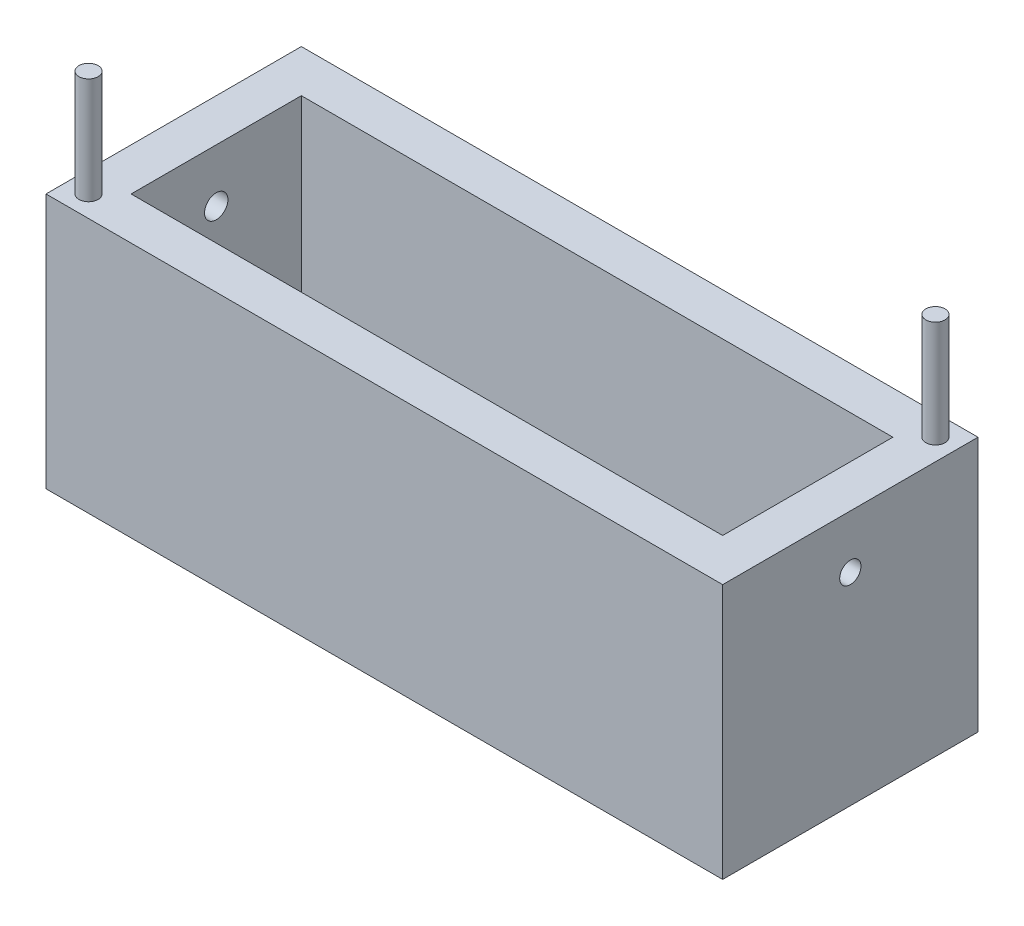
ISO-10303-21;
HEADER;
FILE_DESCRIPTION(('STEP AP214'),'2;1');
FILE_NAME('part.step','',(''),(''),'','','');
FILE_SCHEMA(('AUTOMOTIVE_DESIGN { 1 0 10303 214 1 1 1 1 }'));
ENDSEC;
DATA;
#1=APPLICATION_CONTEXT('core data for automotive mechanical design processes');
#2=APPLICATION_PROTOCOL_DEFINITION('international standard','automotive_design',2000,#1);
#3=PRODUCT_CONTEXT('',#1,'mechanical');
#4=PRODUCT('Part','Part','',(#3));
#5=PRODUCT_RELATED_PRODUCT_CATEGORY('part','',(#4));
#6=PRODUCT_DEFINITION_FORMATION('','',#4);
#7=PRODUCT_DEFINITION_CONTEXT('part definition',#1,'design');
#8=PRODUCT_DEFINITION('design','',#6,#7);
#9=PRODUCT_DEFINITION_SHAPE('','',#8);
#10=(LENGTH_UNIT() NAMED_UNIT(*) SI_UNIT(.MILLI.,.METRE.));
#11=(NAMED_UNIT(*) PLANE_ANGLE_UNIT() SI_UNIT($,.RADIAN.));
#12=(NAMED_UNIT(*) SI_UNIT($,.STERADIAN.) SOLID_ANGLE_UNIT());
#13=UNCERTAINTY_MEASURE_WITH_UNIT(LENGTH_MEASURE(1.E-05),#10,'distance_accuracy_value','');
#14=(GEOMETRIC_REPRESENTATION_CONTEXT(3) GLOBAL_UNCERTAINTY_ASSIGNED_CONTEXT((#13)) GLOBAL_UNIT_ASSIGNED_CONTEXT((#10,
#11,#12)) REPRESENTATION_CONTEXT('',''));
#15=CARTESIAN_POINT('',(0.,0.,0.));
#16=DIRECTION('',(0.,0.,1.));
#17=DIRECTION('',(1.,0.,0.));
#18=AXIS2_PLACEMENT_3D('',#15,#16,#17);
#19=CARTESIAN_POINT('',(0.,0.,152.4));
#20=DIRECTION('',(-1.,0.,0.));
#21=DIRECTION('',(0.,0.,1.));
#22=AXIS2_PLACEMENT_3D('',#19,#20,#21);
#23=PLANE('',#22);
#24=CARTESIAN_POINT('',(0.,120.65,76.2));
#25=DIRECTION('',(1.,0.,0.));
#26=DIRECTION('',(0.,0.,-1.));
#27=AXIS2_PLACEMENT_3D('',#24,#25,#26);
#28=CIRCLE('',#27,6.34999999999999);
#29=CARTESIAN_POINT('',(0.,120.65,69.85));
#30=VERTEX_POINT('',#29);
#31=EDGE_CURVE('E174',#30,#30,#28,.T.);
#32=ORIENTED_EDGE('',*,*,#31,.F.);
#33=EDGE_LOOP('',(#32));
#34=FACE_BOUND('',#33,.T.);
#35=DIRECTION('',(0.,1.,0.));
#36=VECTOR('',#35,1.);
#37=CARTESIAN_POINT('',(0.,0.,0.));
#38=LINE('',#37,#36);
#39=CARTESIAN_POINT('',(0.,0.,0.));
#40=VERTEX_POINT('',#39);
#41=CARTESIAN_POINT('',(0.,152.4,0.));
#42=VERTEX_POINT('',#41);
#43=EDGE_CURVE('E145',#40,#42,#38,.T.);
#44=ORIENTED_EDGE('',*,*,#43,.T.);
#45=DIRECTION('',(0.,0.,-1.));
#46=VECTOR('',#45,1.);
#47=CARTESIAN_POINT('',(0.,152.4,152.4));
#48=LINE('',#47,#46);
#49=CARTESIAN_POINT('',(0.,152.4,152.4));
#50=VERTEX_POINT('',#49);
#51=EDGE_CURVE('E169',#50,#42,#48,.T.);
#52=ORIENTED_EDGE('',*,*,#51,.F.);
#53=DIRECTION('',(0.,1.,0.));
#54=VECTOR('',#53,1.);
#55=CARTESIAN_POINT('',(0.,0.,152.4));
#56=LINE('',#55,#54);
#57=CARTESIAN_POINT('',(0.,0.,152.4));
#58=VERTEX_POINT('',#57);
#59=EDGE_CURVE('E149',#58,#50,#56,.T.);
#60=ORIENTED_EDGE('',*,*,#59,.F.);
#61=DIRECTION('',(0.,0.,-1.));
#62=VECTOR('',#61,1.);
#63=CARTESIAN_POINT('',(0.,0.,152.4));
#64=LINE('',#63,#62);
#65=EDGE_CURVE('E155',#58,#40,#64,.T.);
#66=ORIENTED_EDGE('',*,*,#65,.T.);
#67=EDGE_LOOP('',(#44,#52,#60,#66));
#68=FACE_BOUND('',#67,.T.);
#69=ADVANCED_FACE('F33',(#34,#68),#23,.F.);
#70=CARTESIAN_POINT('',(0.,152.4,152.4));
#71=DIRECTION('',(0.,-1.,0.));
#72=DIRECTION('',(1.,0.,0.));
#73=AXIS2_PLACEMENT_3D('',#70,#71,#72);
#74=PLANE('',#73);
#75=CARTESIAN_POINT('',(-12.7,152.4,12.7));
#76=DIRECTION('',(0.,-1.,0.));
#77=DIRECTION('',(1.,0.,0.));
#78=AXIS2_PLACEMENT_3D('',#75,#76,#77);
#79=CIRCLE('',#78,5.715);
#80=CARTESIAN_POINT('',(-6.98500000000002,152.4,12.7));
#81=VERTEX_POINT('',#80);
#82=EDGE_CURVE('E11',#81,#81,#79,.F.);
#83=ORIENTED_EDGE('',*,*,#82,.F.);
#84=EDGE_LOOP('',(#83));
#85=FACE_BOUND('',#84,.T.);
#86=CARTESIAN_POINT('',(-391.16,152.4,139.7));
#87=DIRECTION('',(0.,-1.,0.));
#88=DIRECTION('',(1.,0.,0.));
#89=AXIS2_PLACEMENT_3D('',#86,#87,#88);
#90=CIRCLE('',#89,5.71500000000004);
#91=CARTESIAN_POINT('',(-385.445,152.4,139.7));
#92=VERTEX_POINT('',#91);
#93=EDGE_CURVE('E40',#92,#92,#90,.F.);
#94=ORIENTED_EDGE('',*,*,#93,.F.);
#95=EDGE_LOOP('',(#94));
#96=FACE_BOUND('',#95,.T.);
#97=DIRECTION('',(1.,0.,0.));
#98=VECTOR('',#97,1.);
#99=CARTESIAN_POINT('',(-378.46,152.4,127.));
#100=LINE('',#99,#98);
#101=CARTESIAN_POINT('',(-378.46,152.4,127.));
#102=VERTEX_POINT('',#101);
#103=CARTESIAN_POINT('',(-25.4,152.4,127.));
#104=VERTEX_POINT('',#103);
#105=EDGE_CURVE('E139',#102,#104,#100,.T.);
#106=ORIENTED_EDGE('',*,*,#105,.F.);
#107=DIRECTION('',(0.,0.,1.));
#108=VECTOR('',#107,1.);
#109=CARTESIAN_POINT('',(-378.46,152.4,25.4));
#110=LINE('',#109,#108);
#111=CARTESIAN_POINT('',(-378.46,152.4,25.4));
#112=VERTEX_POINT('',#111);
#113=EDGE_CURVE('E47',#112,#102,#110,.T.);
#114=ORIENTED_EDGE('',*,*,#113,.F.);
#115=DIRECTION('',(-1.,0.,0.));
#116=VECTOR('',#115,1.);
#117=CARTESIAN_POINT('',(-378.46,152.4,25.4));
#118=LINE('',#117,#116);
#119=CARTESIAN_POINT('',(-25.4,152.4,25.4));
#120=VERTEX_POINT('',#119);
#121=EDGE_CURVE('E127',#120,#112,#118,.T.);
#122=ORIENTED_EDGE('',*,*,#121,.F.);
#123=DIRECTION('',(0.,0.,-1.));
#124=VECTOR('',#123,1.);
#125=CARTESIAN_POINT('',(-25.4,152.4,25.4));
#126=LINE('',#125,#124);
#127=EDGE_CURVE('E130',#104,#120,#126,.T.);
#128=ORIENTED_EDGE('',*,*,#127,.F.);
#129=EDGE_LOOP('',(#106,#114,#122,#128));
#130=FACE_BOUND('',#129,.T.);
#131=DIRECTION('',(-1.,0.,0.));
#132=VECTOR('',#131,1.);
#133=CARTESIAN_POINT('',(0.,152.4,0.));
#134=LINE('',#133,#132);
#135=CARTESIAN_POINT('',(-403.86,152.4,0.));
#136=VERTEX_POINT('',#135);
#137=EDGE_CURVE('E158',#42,#136,#134,.T.);
#138=ORIENTED_EDGE('',*,*,#137,.T.);
#139=DIRECTION('',(0.,0.,-1.));
#140=VECTOR('',#139,1.);
#141=CARTESIAN_POINT('',(-403.86,152.4,152.4));
#142=LINE('',#141,#140);
#143=CARTESIAN_POINT('',(-403.86,152.4,152.4));
#144=VERTEX_POINT('',#143);
#145=EDGE_CURVE('E166',#144,#136,#142,.T.);
#146=ORIENTED_EDGE('',*,*,#145,.F.);
#147=DIRECTION('',(-1.,0.,0.));
#148=VECTOR('',#147,1.);
#149=CARTESIAN_POINT('',(0.,152.4,152.4));
#150=LINE('',#149,#148);
#151=EDGE_CURVE('E85',#50,#144,#150,.T.);
#152=ORIENTED_EDGE('',*,*,#151,.F.);
#153=ORIENTED_EDGE('',*,*,#51,.T.);
#154=EDGE_LOOP('',(#138,#146,#152,#153));
#155=FACE_BOUND('',#154,.T.);
#156=ADVANCED_FACE('F201',(#85,#96,#130,#155),#74,.F.);
#157=CARTESIAN_POINT('',(-403.86,0.,152.4));
#158=DIRECTION('',(1.,0.,0.));
#159=DIRECTION('',(0.,0.,-1.));
#160=AXIS2_PLACEMENT_3D('',#157,#158,#159);
#161=PLANE('',#160);
#162=CARTESIAN_POINT('',(-403.86,120.65,76.2));
#163=DIRECTION('',(-1.,0.,0.));
#164=DIRECTION('',(0.,0.,1.));
#165=AXIS2_PLACEMENT_3D('',#162,#163,#164);
#166=CIRCLE('',#165,6.985);
#167=CARTESIAN_POINT('',(-403.86,120.65,83.185));
#168=VERTEX_POINT('',#167);
#169=EDGE_CURVE('E179',#168,#168,#166,.T.);
#170=ORIENTED_EDGE('',*,*,#169,.F.);
#171=EDGE_LOOP('',(#170));
#172=FACE_BOUND('',#171,.T.);
#173=DIRECTION('',(0.,-1.,0.));
#174=VECTOR('',#173,1.);
#175=CARTESIAN_POINT('',(-403.86,0.,0.));
#176=LINE('',#175,#174);
#177=CARTESIAN_POINT('',(-403.86,0.,0.));
#178=VERTEX_POINT('',#177);
#179=EDGE_CURVE('E160',#136,#178,#176,.T.);
#180=ORIENTED_EDGE('',*,*,#179,.T.);
#181=DIRECTION('',(0.,0.,-1.));
#182=VECTOR('',#181,1.);
#183=CARTESIAN_POINT('',(-403.86,0.,152.4));
#184=LINE('',#183,#182);
#185=CARTESIAN_POINT('',(-403.86,0.,152.4));
#186=VERTEX_POINT('',#185);
#187=EDGE_CURVE('E164',#186,#178,#184,.T.);
#188=ORIENTED_EDGE('',*,*,#187,.F.);
#189=DIRECTION('',(0.,-1.,0.));
#190=VECTOR('',#189,1.);
#191=CARTESIAN_POINT('',(-403.86,0.,152.4));
#192=LINE('',#191,#190);
#193=EDGE_CURVE('E152',#144,#186,#192,.T.);
#194=ORIENTED_EDGE('',*,*,#193,.F.);
#195=ORIENTED_EDGE('',*,*,#145,.T.);
#196=EDGE_LOOP('',(#180,#188,#194,#195));
#197=FACE_BOUND('',#196,.T.);
#198=ADVANCED_FACE('F204',(#172,#197),#161,.F.);
#199=CARTESIAN_POINT('',(0.,0.,152.4));
#200=DIRECTION('',(0.,1.,0.));
#201=DIRECTION('',(-1.,0.,0.));
#202=AXIS2_PLACEMENT_3D('',#199,#200,#201);
#203=PLANE('',#202);
#204=DIRECTION('',(1.,0.,0.));
#205=VECTOR('',#204,1.);
#206=CARTESIAN_POINT('',(0.,0.,0.));
#207=LINE('',#206,#205);
#208=EDGE_CURVE('E77',#178,#40,#207,.T.);
#209=ORIENTED_EDGE('',*,*,#208,.T.);
#210=ORIENTED_EDGE('',*,*,#65,.F.);
#211=DIRECTION('',(1.,0.,0.));
#212=VECTOR('',#211,1.);
#213=CARTESIAN_POINT('',(0.,0.,152.4));
#214=LINE('',#213,#212);
#215=EDGE_CURVE('E56',#186,#58,#214,.T.);
#216=ORIENTED_EDGE('',*,*,#215,.F.);
#217=ORIENTED_EDGE('',*,*,#187,.T.);
#218=EDGE_LOOP('',(#209,#210,#216,#217));
#219=FACE_BOUND('',#218,.T.);
#220=ADVANCED_FACE('F218',(#219),#203,.F.);
#221=CARTESIAN_POINT('',(0.,0.,152.4));
#222=DIRECTION('',(0.,0.,1.));
#223=DIRECTION('',(1.,0.,0.));
#224=AXIS2_PLACEMENT_3D('',#221,#222,#223);
#225=PLANE('',#224);
#226=ORIENTED_EDGE('',*,*,#59,.T.);
#227=ORIENTED_EDGE('',*,*,#151,.T.);
#228=ORIENTED_EDGE('',*,*,#193,.T.);
#229=ORIENTED_EDGE('',*,*,#215,.T.);
#230=EDGE_LOOP('',(#226,#227,#228,#229));
#231=FACE_BOUND('',#230,.T.);
#232=ADVANCED_FACE('F220',(#231),#225,.T.);
#233=CARTESIAN_POINT('',(0.,0.,0.));
#234=DIRECTION('',(0.,0.,1.));
#235=DIRECTION('',(1.,0.,0.));
#236=AXIS2_PLACEMENT_3D('',#233,#234,#235);
#237=PLANE('',#236);
#238=ORIENTED_EDGE('',*,*,#43,.F.);
#239=ORIENTED_EDGE('',*,*,#208,.F.);
#240=ORIENTED_EDGE('',*,*,#179,.F.);
#241=ORIENTED_EDGE('',*,*,#137,.F.);
#242=EDGE_LOOP('',(#238,#239,#240,#241));
#243=FACE_BOUND('',#242,.T.);
#244=ADVANCED_FACE('F215',(#243),#237,.F.);
#245=CARTESIAN_POINT('',(-378.46,12.7,25.4));
#246=DIRECTION('',(-1.,0.,0.));
#247=DIRECTION('',(0.,-1.,0.));
#248=AXIS2_PLACEMENT_3D('',#245,#246,#247);
#249=PLANE('',#248);
#250=CARTESIAN_POINT('',(-378.46,120.65,76.2));
#251=DIRECTION('',(-1.,0.,0.));
#252=DIRECTION('',(0.,-1.,0.));
#253=AXIS2_PLACEMENT_3D('',#250,#251,#252);
#254=CIRCLE('',#253,6.985);
#255=CARTESIAN_POINT('',(-378.46,113.665,76.2));
#256=VERTEX_POINT('',#255);
#257=EDGE_CURVE('E183',#256,#256,#254,.F.);
#258=ORIENTED_EDGE('',*,*,#257,.F.);
#259=EDGE_LOOP('',(#258));
#260=FACE_BOUND('',#259,.T.);
#261=ORIENTED_EDGE('',*,*,#113,.T.);
#262=DIRECTION('',(0.,1.,0.));
#263=VECTOR('',#262,1.);
#264=CARTESIAN_POINT('',(-378.46,12.7,127.));
#265=LINE('',#264,#263);
#266=CARTESIAN_POINT('',(-378.46,12.7,127.));
#267=VERTEX_POINT('',#266);
#268=EDGE_CURVE('E105',#267,#102,#265,.T.);
#269=ORIENTED_EDGE('',*,*,#268,.F.);
#270=DIRECTION('',(0.,0.,1.));
#271=VECTOR('',#270,1.);
#272=CARTESIAN_POINT('',(-378.46,12.7,25.4));
#273=LINE('',#272,#271);
#274=CARTESIAN_POINT('',(-378.46,12.7,25.4));
#275=VERTEX_POINT('',#274);
#276=EDGE_CURVE('E109',#275,#267,#273,.T.);
#277=ORIENTED_EDGE('',*,*,#276,.F.);
#278=DIRECTION('',(0.,1.,0.));
#279=VECTOR('',#278,1.);
#280=CARTESIAN_POINT('',(-378.46,12.7,25.4));
#281=LINE('',#280,#279);
#282=EDGE_CURVE('E143',#275,#112,#281,.T.);
#283=ORIENTED_EDGE('',*,*,#282,.T.);
#284=EDGE_LOOP('',(#261,#269,#277,#283));
#285=FACE_BOUND('',#284,.T.);
#286=ADVANCED_FACE('F107',(#260,#285),#249,.F.);
#287=CARTESIAN_POINT('',(-378.46,12.7,25.4));
#288=DIRECTION('',(0.,0.,-1.));
#289=DIRECTION('',(-1.,0.,0.));
#290=AXIS2_PLACEMENT_3D('',#287,#288,#289);
#291=PLANE('',#290);
#292=ORIENTED_EDGE('',*,*,#121,.T.);
#293=ORIENTED_EDGE('',*,*,#282,.F.);
#294=DIRECTION('',(-1.,0.,0.));
#295=VECTOR('',#294,1.);
#296=CARTESIAN_POINT('',(-378.46,12.7,25.4));
#297=LINE('',#296,#295);
#298=CARTESIAN_POINT('',(-25.4,12.7,25.4));
#299=VERTEX_POINT('',#298);
#300=EDGE_CURVE('E115',#299,#275,#297,.T.);
#301=ORIENTED_EDGE('',*,*,#300,.F.);
#302=DIRECTION('',(0.,1.,0.));
#303=VECTOR('',#302,1.);
#304=CARTESIAN_POINT('',(-25.4,12.7,25.4));
#305=LINE('',#304,#303);
#306=EDGE_CURVE('E146',#299,#120,#305,.T.);
#307=ORIENTED_EDGE('',*,*,#306,.T.);
#308=EDGE_LOOP('',(#292,#293,#301,#307));
#309=FACE_BOUND('',#308,.T.);
#310=ADVANCED_FACE('F261',(#309),#291,.F.);
#311=CARTESIAN_POINT('',(-25.4,12.7,25.4));
#312=DIRECTION('',(1.,0.,0.));
#313=DIRECTION('',(0.,1.,0.));
#314=AXIS2_PLACEMENT_3D('',#311,#312,#313);
#315=PLANE('',#314);
#316=CARTESIAN_POINT('',(-25.4,120.65,76.2));
#317=DIRECTION('',(1.,0.,0.));
#318=DIRECTION('',(0.,1.,0.));
#319=AXIS2_PLACEMENT_3D('',#316,#317,#318);
#320=CIRCLE('',#319,6.34999999999999);
#321=CARTESIAN_POINT('',(-25.4,127.,76.2));
#322=VERTEX_POINT('',#321);
#323=EDGE_CURVE('E172',#322,#322,#320,.T.);
#324=ORIENTED_EDGE('',*,*,#323,.T.);
#325=EDGE_LOOP('',(#324));
#326=FACE_BOUND('',#325,.T.);
#327=ORIENTED_EDGE('',*,*,#127,.T.);
#328=ORIENTED_EDGE('',*,*,#306,.F.);
#329=DIRECTION('',(0.,0.,-1.));
#330=VECTOR('',#329,1.);
#331=CARTESIAN_POINT('',(-25.4,12.7,25.4));
#332=LINE('',#331,#330);
#333=CARTESIAN_POINT('',(-25.4,12.7,127.));
#334=VERTEX_POINT('',#333);
#335=EDGE_CURVE('E123',#334,#299,#332,.T.);
#336=ORIENTED_EDGE('',*,*,#335,.F.);
#337=DIRECTION('',(0.,1.,0.));
#338=VECTOR('',#337,1.);
#339=CARTESIAN_POINT('',(-25.4,12.7,127.));
#340=LINE('',#339,#338);
#341=EDGE_CURVE('E114',#334,#104,#340,.T.);
#342=ORIENTED_EDGE('',*,*,#341,.T.);
#343=EDGE_LOOP('',(#327,#328,#336,#342));
#344=FACE_BOUND('',#343,.T.);
#345=ADVANCED_FACE('F303',(#326,#344),#315,.F.);
#346=CARTESIAN_POINT('',(-378.46,12.7,127.));
#347=DIRECTION('',(0.,0.,1.));
#348=DIRECTION('',(1.,0.,0.));
#349=AXIS2_PLACEMENT_3D('',#346,#347,#348);
#350=PLANE('',#349);
#351=ORIENTED_EDGE('',*,*,#105,.T.);
#352=ORIENTED_EDGE('',*,*,#341,.F.);
#353=DIRECTION('',(1.,0.,0.));
#354=VECTOR('',#353,1.);
#355=CARTESIAN_POINT('',(-378.46,12.7,127.));
#356=LINE('',#355,#354);
#357=EDGE_CURVE('E118',#267,#334,#356,.T.);
#358=ORIENTED_EDGE('',*,*,#357,.F.);
#359=ORIENTED_EDGE('',*,*,#268,.T.);
#360=EDGE_LOOP('',(#351,#352,#358,#359));
#361=FACE_BOUND('',#360,.T.);
#362=ADVANCED_FACE('F119',(#361),#350,.F.);
#363=CARTESIAN_POINT('',(0.,12.7,0.));
#364=DIRECTION('',(0.,1.,0.));
#365=DIRECTION('',(-1.,0.,0.));
#366=AXIS2_PLACEMENT_3D('',#363,#364,#365);
#367=PLANE('',#366);
#368=ORIENTED_EDGE('',*,*,#276,.T.);
#369=ORIENTED_EDGE('',*,*,#357,.T.);
#370=ORIENTED_EDGE('',*,*,#335,.T.);
#371=ORIENTED_EDGE('',*,*,#300,.T.);
#372=EDGE_LOOP('',(#368,#369,#370,#371));
#373=FACE_BOUND('',#372,.T.);
#374=ADVANCED_FACE('F125',(#373),#367,.T.);
#375=CARTESIAN_POINT('',(-391.16,215.9,139.7));
#376=DIRECTION('',(0.,-1.,0.));
#377=DIRECTION('',(1.,0.,0.));
#378=AXIS2_PLACEMENT_3D('',#375,#376,#377);
#379=CYLINDRICAL_SURFACE('',#378,5.71500000000004);
#380=CARTESIAN_POINT('',(-391.16,215.9,139.7));
#381=DIRECTION('',(0.,1.,0.));
#382=DIRECTION('',(-1.,0.,0.));
#383=AXIS2_PLACEMENT_3D('',#380,#381,#382);
#384=CIRCLE('',#383,5.71500000000004);
#385=CARTESIAN_POINT('',(-396.875,215.9,139.7));
#386=VERTEX_POINT('',#385);
#387=EDGE_CURVE('E133',#386,#386,#384,.T.);
#388=ORIENTED_EDGE('',*,*,#387,.F.);
#389=EDGE_LOOP('',(#388));
#390=FACE_BOUND('',#389,.T.);
#391=ORIENTED_EDGE('',*,*,#93,.T.);
#392=EDGE_LOOP('',(#391));
#393=FACE_BOUND('',#392,.T.);
#394=ADVANCED_FACE('F295',(#390,#393),#379,.T.);
#395=CARTESIAN_POINT('',(-391.16,215.9,139.7));
#396=DIRECTION('',(0.,1.,0.));
#397=DIRECTION('',(-1.,0.,0.));
#398=AXIS2_PLACEMENT_3D('',#395,#396,#397);
#399=PLANE('',#398);
#400=ORIENTED_EDGE('',*,*,#387,.T.);
#401=EDGE_LOOP('',(#400));
#402=FACE_BOUND('',#401,.T.);
#403=ADVANCED_FACE('F293',(#402),#399,.T.);
#404=CARTESIAN_POINT('',(-63.5,120.65,76.2));
#405=DIRECTION('',(1.,0.,0.));
#406=DIRECTION('',(0.,0.,-1.));
#407=AXIS2_PLACEMENT_3D('',#404,#405,#406);
#408=CYLINDRICAL_SURFACE('',#407,6.34999999999999);
#409=ORIENTED_EDGE('',*,*,#31,.T.);
#410=EDGE_LOOP('',(#409));
#411=FACE_BOUND('',#410,.T.);
#412=ORIENTED_EDGE('',*,*,#323,.F.);
#413=EDGE_LOOP('',(#412));
#414=FACE_BOUND('',#413,.T.);
#415=ADVANCED_FACE('F255',(#411,#414),#408,.F.);
#416=CARTESIAN_POINT('',(0.000999999999973245,120.65,76.2));
#417=DIRECTION('',(-1.,0.,0.));
#418=DIRECTION('',(0.,0.,1.));
#419=AXIS2_PLACEMENT_3D('',#416,#417,#418);
#420=CYLINDRICAL_SURFACE('',#419,6.985);
#421=ORIENTED_EDGE('',*,*,#169,.T.);
#422=EDGE_LOOP('',(#421));
#423=FACE_BOUND('',#422,.T.);
#424=ORIENTED_EDGE('',*,*,#257,.T.);
#425=EDGE_LOOP('',(#424));
#426=FACE_BOUND('',#425,.T.);
#427=ADVANCED_FACE('F197',(#423,#426),#420,.F.);
#428=CARTESIAN_POINT('',(-12.7,215.9,12.7));
#429=DIRECTION('',(0.,-1.,0.));
#430=DIRECTION('',(1.,0.,0.));
#431=AXIS2_PLACEMENT_3D('',#428,#429,#430);
#432=CYLINDRICAL_SURFACE('',#431,5.715);
#433=CARTESIAN_POINT('',(-12.7,215.9,12.7));
#434=DIRECTION('',(0.,1.,0.));
#435=DIRECTION('',(-1.,0.,0.));
#436=AXIS2_PLACEMENT_3D('',#433,#434,#435);
#437=CIRCLE('',#436,5.715);
#438=CARTESIAN_POINT('',(-18.415,215.9,12.7));
#439=VERTEX_POINT('',#438);
#440=EDGE_CURVE('E188',#439,#439,#437,.T.);
#441=ORIENTED_EDGE('',*,*,#440,.F.);
#442=EDGE_LOOP('',(#441));
#443=FACE_BOUND('',#442,.T.);
#444=ORIENTED_EDGE('',*,*,#82,.T.);
#445=EDGE_LOOP('',(#444));
#446=FACE_BOUND('',#445,.T.);
#447=ADVANCED_FACE('F194',(#443,#446),#432,.T.);
#448=CARTESIAN_POINT('',(-12.7,215.9,12.7));
#449=DIRECTION('',(0.,1.,0.));
#450=DIRECTION('',(-1.,0.,0.));
#451=AXIS2_PLACEMENT_3D('',#448,#449,#450);
#452=PLANE('',#451);
#453=ORIENTED_EDGE('',*,*,#440,.T.);
#454=EDGE_LOOP('',(#453));
#455=FACE_BOUND('',#454,.T.);
#456=ADVANCED_FACE('F192',(#455),#452,.T.);
#457=CLOSED_SHELL('',(#69,#156,#198,#220,#232,#244,#286,#310,#345,#362,#374,#394,#403,#415,#427,
#447,#456));
#458=MANIFOLD_SOLID_BREP('B2',#457);
#459=ADVANCED_BREP_SHAPE_REPRESENTATION('',(#18,#458),#14);
#460=SHAPE_DEFINITION_REPRESENTATION(#9,#459);
ENDSEC;
END-ISO-10303-21;
